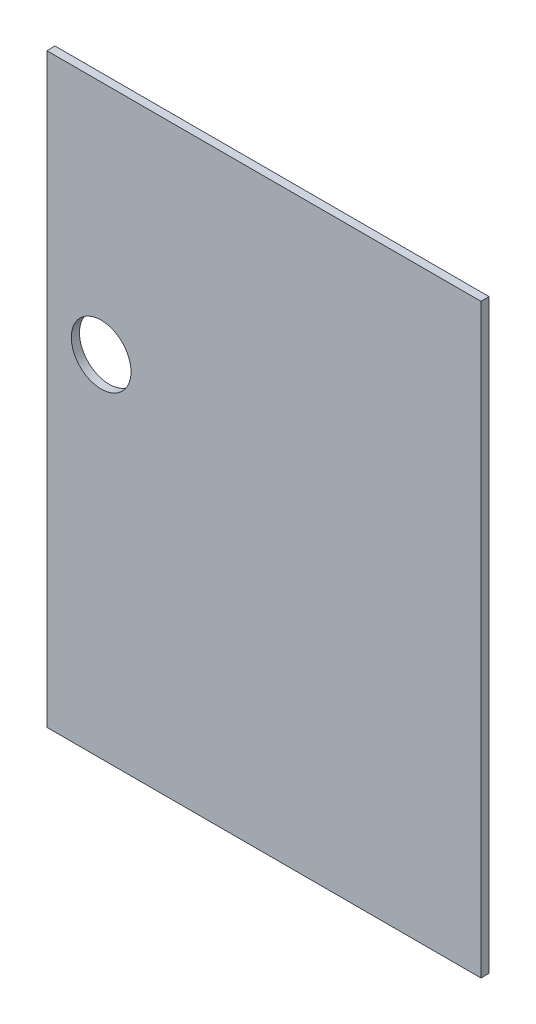
ISO-10303-21;
HEADER;
FILE_DESCRIPTION(('STEP AP214'),'2;1');
FILE_NAME('part.step','',(''),(''),'','','');
FILE_SCHEMA(('AUTOMOTIVE_DESIGN { 1 0 10303 214 1 1 1 1 }'));
ENDSEC;
DATA;
#1=APPLICATION_CONTEXT('core data for automotive mechanical design processes');
#2=APPLICATION_PROTOCOL_DEFINITION('international standard','automotive_design',2000,#1);
#3=PRODUCT_CONTEXT('',#1,'mechanical');
#4=PRODUCT('Part','Part','',(#3));
#5=PRODUCT_RELATED_PRODUCT_CATEGORY('part','',(#4));
#6=PRODUCT_DEFINITION_FORMATION('','',#4);
#7=PRODUCT_DEFINITION_CONTEXT('part definition',#1,'design');
#8=PRODUCT_DEFINITION('design','',#6,#7);
#9=PRODUCT_DEFINITION_SHAPE('','',#8);
#10=(LENGTH_UNIT() NAMED_UNIT(*) SI_UNIT(.MILLI.,.METRE.));
#11=(NAMED_UNIT(*) PLANE_ANGLE_UNIT() SI_UNIT($,.RADIAN.));
#12=(NAMED_UNIT(*) SI_UNIT($,.STERADIAN.) SOLID_ANGLE_UNIT());
#13=UNCERTAINTY_MEASURE_WITH_UNIT(LENGTH_MEASURE(1.E-05),#10,'distance_accuracy_value','');
#14=(GEOMETRIC_REPRESENTATION_CONTEXT(3) GLOBAL_UNCERTAINTY_ASSIGNED_CONTEXT((#13)) GLOBAL_UNIT_ASSIGNED_CONTEXT((#10,
#11,#12)) REPRESENTATION_CONTEXT('',''));
#15=CARTESIAN_POINT('',(0.,0.,0.));
#16=DIRECTION('',(0.,0.,1.));
#17=DIRECTION('',(1.,0.,0.));
#18=AXIS2_PLACEMENT_3D('',#15,#16,#17);
#19=CARTESIAN_POINT('',(0.,0.,3.));
#20=DIRECTION('',(1.,0.,0.));
#21=DIRECTION('',(0.,0.,-1.));
#22=AXIS2_PLACEMENT_3D('',#19,#20,#21);
#23=PLANE('',#22);
#24=DIRECTION('',(0.,-1.,0.));
#25=VECTOR('',#24,1.);
#26=CARTESIAN_POINT('',(0.,0.,0.));
#27=LINE('',#26,#25);
#28=CARTESIAN_POINT('',(0.,216.,0.));
#29=VERTEX_POINT('',#28);
#30=CARTESIAN_POINT('',(0.,0.,0.));
#31=VERTEX_POINT('',#30);
#32=EDGE_CURVE('E115',#29,#31,#27,.T.);
#33=ORIENTED_EDGE('',*,*,#32,.T.);
#34=DIRECTION('',(0.,0.,-1.));
#35=VECTOR('',#34,1.);
#36=CARTESIAN_POINT('',(0.,0.,3.));
#37=LINE('',#36,#35);
#38=CARTESIAN_POINT('',(0.,0.,3.));
#39=VERTEX_POINT('',#38);
#40=EDGE_CURVE('E11',#39,#31,#37,.T.);
#41=ORIENTED_EDGE('',*,*,#40,.F.);
#42=DIRECTION('',(0.,-1.,0.));
#43=VECTOR('',#42,1.);
#44=CARTESIAN_POINT('',(0.,0.,3.));
#45=LINE('',#44,#43);
#46=CARTESIAN_POINT('',(0.,216.,3.));
#47=VERTEX_POINT('',#46);
#48=EDGE_CURVE('E96',#47,#39,#45,.T.);
#49=ORIENTED_EDGE('',*,*,#48,.F.);
#50=DIRECTION('',(0.,0.,-1.));
#51=VECTOR('',#50,1.);
#52=CARTESIAN_POINT('',(0.,216.,3.));
#53=LINE('',#52,#51);
#54=EDGE_CURVE('E107',#47,#29,#53,.T.);
#55=ORIENTED_EDGE('',*,*,#54,.T.);
#56=EDGE_LOOP('',(#33,#41,#49,#55));
#57=FACE_BOUND('',#56,.T.);
#58=ADVANCED_FACE('F42',(#57),#23,.F.);
#59=CARTESIAN_POINT('',(0.,0.,3.));
#60=DIRECTION('',(0.,1.,0.));
#61=DIRECTION('',(0.,0.,1.));
#62=AXIS2_PLACEMENT_3D('',#59,#60,#61);
#63=PLANE('',#62);
#64=DIRECTION('',(1.,0.,0.));
#65=VECTOR('',#64,1.);
#66=CARTESIAN_POINT('',(0.,0.,0.));
#67=LINE('',#66,#65);
#68=CARTESIAN_POINT('',(160.,0.,0.));
#69=VERTEX_POINT('',#68);
#70=EDGE_CURVE('E101',#31,#69,#67,.T.);
#71=ORIENTED_EDGE('',*,*,#70,.T.);
#72=DIRECTION('',(0.,0.,-1.));
#73=VECTOR('',#72,1.);
#74=CARTESIAN_POINT('',(160.,0.,3.));
#75=LINE('',#74,#73);
#76=CARTESIAN_POINT('',(160.,0.,3.));
#77=VERTEX_POINT('',#76);
#78=EDGE_CURVE('E52',#77,#69,#75,.T.);
#79=ORIENTED_EDGE('',*,*,#78,.F.);
#80=DIRECTION('',(1.,0.,0.));
#81=VECTOR('',#80,1.);
#82=CARTESIAN_POINT('',(0.,0.,3.));
#83=LINE('',#82,#81);
#84=EDGE_CURVE('E93',#39,#77,#83,.T.);
#85=ORIENTED_EDGE('',*,*,#84,.F.);
#86=ORIENTED_EDGE('',*,*,#40,.T.);
#87=EDGE_LOOP('',(#71,#79,#85,#86));
#88=FACE_BOUND('',#87,.T.);
#89=ADVANCED_FACE('F99',(#88),#63,.F.);
#90=CARTESIAN_POINT('',(160.,0.,3.));
#91=DIRECTION('',(-1.,0.,0.));
#92=DIRECTION('',(0.,0.,1.));
#93=AXIS2_PLACEMENT_3D('',#90,#91,#92);
#94=PLANE('',#93);
#95=DIRECTION('',(0.,1.,0.));
#96=VECTOR('',#95,1.);
#97=CARTESIAN_POINT('',(160.,0.,0.));
#98=LINE('',#97,#96);
#99=CARTESIAN_POINT('',(160.,216.,0.));
#100=VERTEX_POINT('',#99);
#101=EDGE_CURVE('E79',#69,#100,#98,.T.);
#102=ORIENTED_EDGE('',*,*,#101,.T.);
#103=DIRECTION('',(0.,0.,-1.));
#104=VECTOR('',#103,1.);
#105=CARTESIAN_POINT('',(160.,216.,3.));
#106=LINE('',#105,#104);
#107=CARTESIAN_POINT('',(160.,216.,3.));
#108=VERTEX_POINT('',#107);
#109=EDGE_CURVE('E103',#108,#100,#106,.T.);
#110=ORIENTED_EDGE('',*,*,#109,.F.);
#111=DIRECTION('',(0.,1.,0.));
#112=VECTOR('',#111,1.);
#113=CARTESIAN_POINT('',(160.,0.,3.));
#114=LINE('',#113,#112);
#115=EDGE_CURVE('E94',#77,#108,#114,.T.);
#116=ORIENTED_EDGE('',*,*,#115,.F.);
#117=ORIENTED_EDGE('',*,*,#78,.T.);
#118=EDGE_LOOP('',(#102,#110,#116,#117));
#119=FACE_BOUND('',#118,.T.);
#120=ADVANCED_FACE('F102',(#119),#94,.F.);
#121=CARTESIAN_POINT('',(0.,216.,3.));
#122=DIRECTION('',(0.,-1.,0.));
#123=DIRECTION('',(0.,0.,-1.));
#124=AXIS2_PLACEMENT_3D('',#121,#122,#123);
#125=PLANE('',#124);
#126=DIRECTION('',(-1.,0.,0.));
#127=VECTOR('',#126,1.);
#128=CARTESIAN_POINT('',(0.,216.,0.));
#129=LINE('',#128,#127);
#130=EDGE_CURVE('E84',#100,#29,#129,.T.);
#131=ORIENTED_EDGE('',*,*,#130,.T.);
#132=ORIENTED_EDGE('',*,*,#54,.F.);
#133=DIRECTION('',(-1.,0.,0.));
#134=VECTOR('',#133,1.);
#135=CARTESIAN_POINT('',(0.,216.,3.));
#136=LINE('',#135,#134);
#137=EDGE_CURVE('E62',#108,#47,#136,.T.);
#138=ORIENTED_EDGE('',*,*,#137,.F.);
#139=ORIENTED_EDGE('',*,*,#109,.T.);
#140=EDGE_LOOP('',(#131,#132,#138,#139));
#141=FACE_BOUND('',#140,.T.);
#142=ADVANCED_FACE('F127',(#141),#125,.F.);
#143=CARTESIAN_POINT('',(0.,0.,3.));
#144=DIRECTION('',(0.,0.,-1.));
#145=DIRECTION('',(-1.,0.,0.));
#146=AXIS2_PLACEMENT_3D('',#143,#144,#145);
#147=PLANE('',#146);
#148=CARTESIAN_POINT('',(20.,129.,3.));
#149=DIRECTION('',(0.,0.,1.));
#150=DIRECTION('',(1.,0.,0.));
#151=AXIS2_PLACEMENT_3D('',#148,#149,#150);
#152=CIRCLE('',#151,11.);
#153=CARTESIAN_POINT('',(31.,129.,3.));
#154=VERTEX_POINT('',#153);
#155=EDGE_CURVE('E134',#154,#154,#152,.T.);
#156=ORIENTED_EDGE('',*,*,#155,.F.);
#157=EDGE_LOOP('',(#156));
#158=FACE_BOUND('',#157,.T.);
#159=ORIENTED_EDGE('',*,*,#48,.T.);
#160=ORIENTED_EDGE('',*,*,#84,.T.);
#161=ORIENTED_EDGE('',*,*,#115,.T.);
#162=ORIENTED_EDGE('',*,*,#137,.T.);
#163=EDGE_LOOP('',(#159,#160,#161,#162));
#164=FACE_BOUND('',#163,.T.);
#165=ADVANCED_FACE('F95',(#158,#164),#147,.F.);
#166=CARTESIAN_POINT('',(0.,0.,0.));
#167=DIRECTION('',(0.,0.,-1.));
#168=DIRECTION('',(-1.,0.,0.));
#169=AXIS2_PLACEMENT_3D('',#166,#167,#168);
#170=PLANE('',#169);
#171=CARTESIAN_POINT('',(20.,129.,0.));
#172=DIRECTION('',(0.,0.,1.));
#173=DIRECTION('',(1.,0.,0.));
#174=AXIS2_PLACEMENT_3D('',#171,#172,#173);
#175=CIRCLE('',#174,11.);
#176=CARTESIAN_POINT('',(31.,129.,0.));
#177=VERTEX_POINT('',#176);
#178=EDGE_CURVE('E117',#177,#177,#175,.T.);
#179=ORIENTED_EDGE('',*,*,#178,.T.);
#180=EDGE_LOOP('',(#179));
#181=FACE_BOUND('',#180,.T.);
#182=ORIENTED_EDGE('',*,*,#32,.F.);
#183=ORIENTED_EDGE('',*,*,#130,.F.);
#184=ORIENTED_EDGE('',*,*,#101,.F.);
#185=ORIENTED_EDGE('',*,*,#70,.F.);
#186=EDGE_LOOP('',(#182,#183,#184,#185));
#187=FACE_BOUND('',#186,.T.);
#188=ADVANCED_FACE('F129',(#181,#187),#170,.T.);
#189=CARTESIAN_POINT('',(20.,129.,0.));
#190=DIRECTION('',(0.,0.,1.));
#191=DIRECTION('',(1.,0.,0.));
#192=AXIS2_PLACEMENT_3D('',#189,#190,#191);
#193=CYLINDRICAL_SURFACE('',#192,11.);
#194=ORIENTED_EDGE('',*,*,#178,.F.);
#195=EDGE_LOOP('',(#194));
#196=FACE_BOUND('',#195,.T.);
#197=ORIENTED_EDGE('',*,*,#155,.T.);
#198=EDGE_LOOP('',(#197));
#199=FACE_BOUND('',#198,.T.);
#200=ADVANCED_FACE('F142',(#196,#199),#193,.F.);
#201=CLOSED_SHELL('',(#58,#89,#120,#142,#165,#188,#200));
#202=MANIFOLD_SOLID_BREP('B2',#201);
#203=ADVANCED_BREP_SHAPE_REPRESENTATION('',(#18,#202),#14);
#204=SHAPE_DEFINITION_REPRESENTATION(#9,#203);
ENDSEC;
END-ISO-10303-21;
